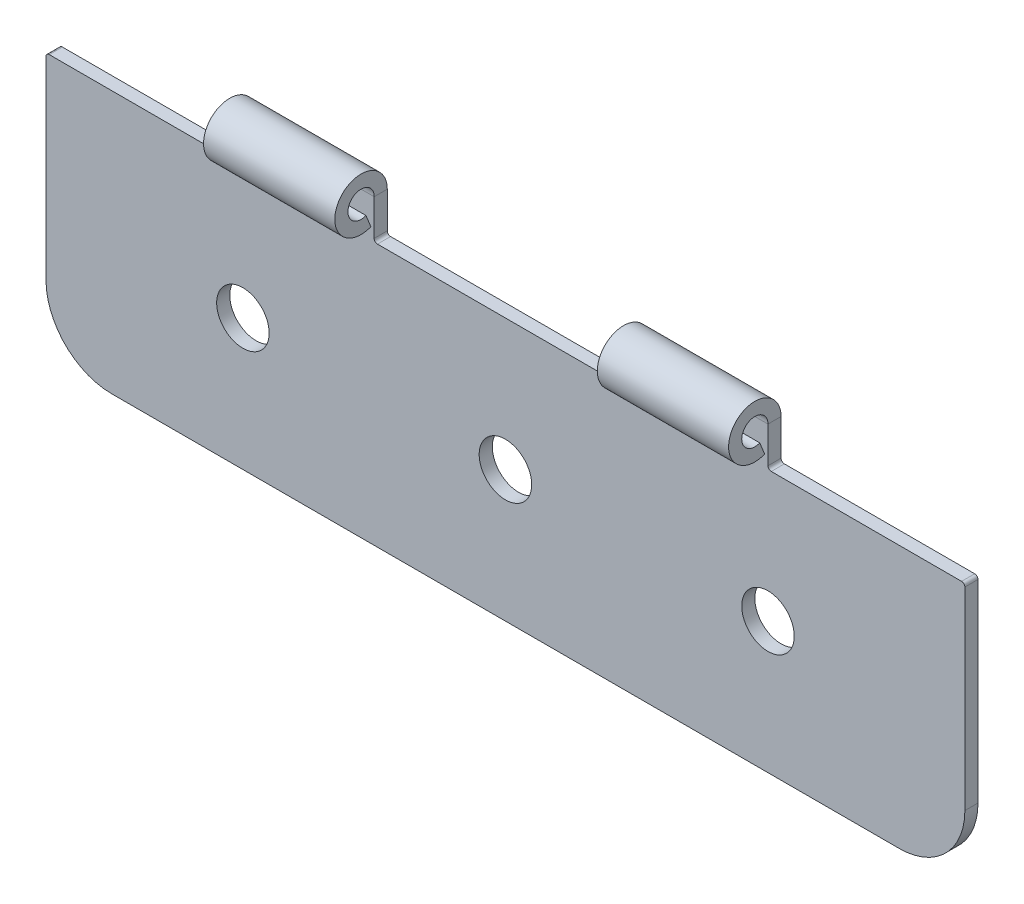
ISO-10303-21;
HEADER;
FILE_DESCRIPTION(('STEP AP214'),'2;1');
FILE_NAME('part.step','',(''),(''),'','','');
FILE_SCHEMA(('AUTOMOTIVE_DESIGN { 1 0 10303 214 1 1 1 1 }'));
ENDSEC;
DATA;
#1=APPLICATION_CONTEXT('core data for automotive mechanical design processes');
#2=APPLICATION_PROTOCOL_DEFINITION('international standard','automotive_design',2000,#1);
#3=PRODUCT_CONTEXT('',#1,'mechanical');
#4=PRODUCT('Part','Part','',(#3));
#5=PRODUCT_RELATED_PRODUCT_CATEGORY('part','',(#4));
#6=PRODUCT_DEFINITION_FORMATION('','',#4);
#7=PRODUCT_DEFINITION_CONTEXT('part definition',#1,'design');
#8=PRODUCT_DEFINITION('design','',#6,#7);
#9=PRODUCT_DEFINITION_SHAPE('','',#8);
#10=(LENGTH_UNIT() NAMED_UNIT(*) SI_UNIT(.MILLI.,.METRE.));
#11=(NAMED_UNIT(*) PLANE_ANGLE_UNIT() SI_UNIT($,.RADIAN.));
#12=(NAMED_UNIT(*) SI_UNIT($,.STERADIAN.) SOLID_ANGLE_UNIT());
#13=UNCERTAINTY_MEASURE_WITH_UNIT(LENGTH_MEASURE(1.E-05),#10,'distance_accuracy_value','');
#14=(GEOMETRIC_REPRESENTATION_CONTEXT(3) GLOBAL_UNCERTAINTY_ASSIGNED_CONTEXT((#13)) GLOBAL_UNIT_ASSIGNED_CONTEXT((#10,
#11,#12)) REPRESENTATION_CONTEXT('',''));
#15=CARTESIAN_POINT('',(0.,0.,0.));
#16=DIRECTION('',(0.,0.,1.));
#17=DIRECTION('',(1.,0.,0.));
#18=AXIS2_PLACEMENT_3D('',#15,#16,#17);
#19=CARTESIAN_POINT('',(85.,52.8350872140625,-3.69698140921907));
#20=DIRECTION('',(-1.,0.,0.));
#21=DIRECTION('',(0.,0.,1.));
#22=AXIS2_PLACEMENT_3D('',#19,#20,#21);
#23=PLANE('',#22);
#24=DIRECTION('',(0.,-1.,0.));
#25=VECTOR('',#24,1.);
#26=CARTESIAN_POINT('',(85.,52.8350872140625,-3.69698140921907));
#27=LINE('',#26,#25);
#28=CARTESIAN_POINT('',(85.,67.8350872140625,-3.69698140921908));
#29=VERTEX_POINT('',#28);
#30=CARTESIAN_POINT('',(85.,54.0850872140625,-3.69698140921907));
#31=VERTEX_POINT('',#30);
#32=EDGE_CURVE('E211',#29,#31,#27,.T.);
#33=ORIENTED_EDGE('',*,*,#32,.T.);
#34=DIRECTION('',(0.,0.,1.));
#35=VECTOR('',#34,1.);
#36=CARTESIAN_POINT('',(85.,54.0850872140625,1.30301859078093));
#37=LINE('',#36,#35);
#38=CARTESIAN_POINT('',(85.,54.0850872140625,1.30301859078093));
#39=VERTEX_POINT('',#38);
#40=EDGE_CURVE('E384',#31,#39,#37,.T.);
#41=ORIENTED_EDGE('',*,*,#40,.T.);
#42=DIRECTION('',(0.,-1.,0.));
#43=VECTOR('',#42,1.);
#44=CARTESIAN_POINT('',(85.,52.8350872140625,1.30301859078093));
#45=LINE('',#44,#43);
#46=CARTESIAN_POINT('',(85.,67.8350872140625,1.30301859078093));
#47=VERTEX_POINT('',#46);
#48=EDGE_CURVE('E327',#47,#39,#45,.T.);
#49=ORIENTED_EDGE('',*,*,#48,.F.);
#50=DIRECTION('',(0.,0.,-1.));
#51=VECTOR('',#50,1.);
#52=CARTESIAN_POINT('',(85.,67.8350872140625,1.30301859078092));
#53=LINE('',#52,#51);
#54=EDGE_CURVE('E223',#47,#29,#53,.T.);
#55=ORIENTED_EDGE('',*,*,#54,.T.);
#56=EDGE_LOOP('',(#33,#41,#49,#55));
#57=FACE_BOUND('',#56,.T.);
#58=ADVANCED_FACE('F44',(#57),#23,.T.);
#59=CARTESIAN_POINT('',(-65.,52.8350872140625,-3.69698140921907));
#60=DIRECTION('',(-1.,0.,0.));
#61=DIRECTION('',(0.,0.,1.));
#62=AXIS2_PLACEMENT_3D('',#59,#60,#61);
#63=PLANE('',#62);
#64=DIRECTION('',(0.,-1.,0.));
#65=VECTOR('',#64,1.);
#66=CARTESIAN_POINT('',(-65.,52.8350872140625,-3.69698140921907));
#67=LINE('',#66,#65);
#68=CARTESIAN_POINT('',(-65.,67.8350872140625,-3.69698140921908));
#69=VERTEX_POINT('',#68);
#70=CARTESIAN_POINT('',(-65.,54.0850872140625,-3.69698140921907));
#71=VERTEX_POINT('',#70);
#72=EDGE_CURVE('E308',#69,#71,#67,.T.);
#73=ORIENTED_EDGE('',*,*,#72,.T.);
#74=DIRECTION('',(0.,0.,1.));
#75=VECTOR('',#74,1.);
#76=CARTESIAN_POINT('',(-65.,54.0850872140625,1.30301859078093));
#77=LINE('',#76,#75);
#78=CARTESIAN_POINT('',(-65.,54.0850872140625,1.30301859078093));
#79=VERTEX_POINT('',#78);
#80=EDGE_CURVE('E387',#71,#79,#77,.T.);
#81=ORIENTED_EDGE('',*,*,#80,.T.);
#82=DIRECTION('',(0.,-1.,0.));
#83=VECTOR('',#82,1.);
#84=CARTESIAN_POINT('',(-65.,52.8350872140625,1.30301859078093));
#85=LINE('',#84,#83);
#86=CARTESIAN_POINT('',(-65.,67.8350872140625,1.30301859078093));
#87=VERTEX_POINT('',#86);
#88=EDGE_CURVE('E335',#87,#79,#85,.T.);
#89=ORIENTED_EDGE('',*,*,#88,.F.);
#90=DIRECTION('',(0.,0.,-1.));
#91=VECTOR('',#90,1.);
#92=CARTESIAN_POINT('',(-65.,67.8350872140625,1.30301859078092));
#93=LINE('',#92,#91);
#94=EDGE_CURVE('E267',#87,#69,#93,.T.);
#95=ORIENTED_EDGE('',*,*,#94,.T.);
#96=EDGE_LOOP('',(#73,#81,#89,#95));
#97=FACE_BOUND('',#96,.T.);
#98=ADVANCED_FACE('F423',(#97),#63,.T.);
#99=CARTESIAN_POINT('',(210.,-47.1649127859375,-3.69698140921907));
#100=DIRECTION('',(0.,-1.,0.));
#101=DIRECTION('',(1.,0.,0.));
#102=AXIS2_PLACEMENT_3D('',#99,#100,#101);
#103=PLANE('',#102);
#104=DIRECTION('',(1.,0.,0.));
#105=VECTOR('',#104,1.);
#106=CARTESIAN_POINT('',(210.,-47.1649127859375,-3.69698140921907));
#107=LINE('',#106,#105);
#108=CARTESIAN_POINT('',(-115.,-47.1649127859375,-3.69698140921907));
#109=VERTEX_POINT('',#108);
#110=CARTESIAN_POINT('',(185.,-47.1649127859375,-3.69698140921907));
#111=VERTEX_POINT('',#110);
#112=EDGE_CURVE('E293',#109,#111,#107,.T.);
#113=ORIENTED_EDGE('',*,*,#112,.T.);
#114=DIRECTION('',(0.,0.,1.));
#115=VECTOR('',#114,1.);
#116=CARTESIAN_POINT('',(185.,-47.1649127859375,-3.69698140921907));
#117=LINE('',#116,#115);
#118=CARTESIAN_POINT('',(185.,-47.1649127859375,1.30301859078093));
#119=VERTEX_POINT('',#118);
#120=EDGE_CURVE('E343',#111,#119,#117,.T.);
#121=ORIENTED_EDGE('',*,*,#120,.T.);
#122=DIRECTION('',(1.,0.,0.));
#123=VECTOR('',#122,1.);
#124=CARTESIAN_POINT('',(210.,-47.1649127859375,1.30301859078093));
#125=LINE('',#124,#123);
#126=CARTESIAN_POINT('',(-115.,-47.1649127859375,1.30301859078093));
#127=VERTEX_POINT('',#126);
#128=EDGE_CURVE('E290',#127,#119,#125,.T.);
#129=ORIENTED_EDGE('',*,*,#128,.F.);
#130=DIRECTION('',(0.,0.,1.));
#131=VECTOR('',#130,1.);
#132=CARTESIAN_POINT('',(-115.,-47.1649127859375,-3.69698140921907));
#133=LINE('',#132,#131);
#134=EDGE_CURVE('E316',#127,#109,#133,.F.);
#135=ORIENTED_EDGE('',*,*,#134,.T.);
#136=EDGE_LOOP('',(#113,#121,#129,#135));
#137=FACE_BOUND('',#136,.T.);
#138=ADVANCED_FACE('F480',(#137),#103,.T.);
#139=CARTESIAN_POINT('',(-140.,-47.1649127859375,-3.69698140921907));
#140=DIRECTION('',(-1.,0.,0.));
#141=DIRECTION('',(0.,0.,1.));
#142=AXIS2_PLACEMENT_3D('',#139,#140,#141);
#143=PLANE('',#142);
#144=DIRECTION('',(0.,-1.,0.));
#145=VECTOR('',#144,1.);
#146=CARTESIAN_POINT('',(-140.,-47.1649127859375,1.30301859078093));
#147=LINE('',#146,#145);
#148=CARTESIAN_POINT('',(-140.,51.5850872140625,1.30301859078093));
#149=VERTEX_POINT('',#148);
#150=CARTESIAN_POINT('',(-140.,-22.1649127859375,1.30301859078093));
#151=VERTEX_POINT('',#150);
#152=EDGE_CURVE('E297',#149,#151,#147,.T.);
#153=ORIENTED_EDGE('',*,*,#152,.F.);
#154=DIRECTION('',(0.,0.,1.));
#155=VECTOR('',#154,1.);
#156=CARTESIAN_POINT('',(-140.,51.5850872140625,-3.69698140921907));
#157=LINE('',#156,#155);
#158=CARTESIAN_POINT('',(-140.,51.5850872140625,-3.69698140921907));
#159=VERTEX_POINT('',#158);
#160=EDGE_CURVE('E395',#149,#159,#157,.F.);
#161=ORIENTED_EDGE('',*,*,#160,.T.);
#162=DIRECTION('',(0.,-1.,0.));
#163=VECTOR('',#162,1.);
#164=CARTESIAN_POINT('',(-140.,-47.1649127859375,-3.69698140921907));
#165=LINE('',#164,#163);
#166=CARTESIAN_POINT('',(-140.,-22.1649127859375,-3.69698140921907));
#167=VERTEX_POINT('',#166);
#168=EDGE_CURVE('E314',#159,#167,#165,.T.);
#169=ORIENTED_EDGE('',*,*,#168,.T.);
#170=DIRECTION('',(0.,0.,1.));
#171=VECTOR('',#170,1.);
#172=CARTESIAN_POINT('',(-140.,-22.1649127859375,-3.69698140921907));
#173=LINE('',#172,#171);
#174=EDGE_CURVE('E357',#167,#151,#173,.T.);
#175=ORIENTED_EDGE('',*,*,#174,.T.);
#176=EDGE_LOOP('',(#153,#161,#169,#175));
#177=FACE_BOUND('',#176,.T.);
#178=ADVANCED_FACE('F497',(#177),#143,.T.);
#179=CARTESIAN_POINT('',(-140.,52.8350872140625,-3.69698140921907));
#180=DIRECTION('',(0.,1.,0.));
#181=DIRECTION('',(0.,0.,1.));
#182=AXIS2_PLACEMENT_3D('',#179,#180,#181);
#183=PLANE('',#182);
#184=DIRECTION('',(-1.,0.,0.));
#185=VECTOR('',#184,1.);
#186=CARTESIAN_POINT('',(-140.,52.8350872140625,1.30301859078093));
#187=LINE('',#186,#185);
#188=CARTESIAN_POINT('',(-66.25,52.8350872140625,1.30301859078093));
#189=VERTEX_POINT('',#188);
#190=CARTESIAN_POINT('',(-138.75,52.8350872140625,1.30301859078093));
#191=VERTEX_POINT('',#190);
#192=EDGE_CURVE('E338',#189,#191,#187,.T.);
#193=ORIENTED_EDGE('',*,*,#192,.F.);
#194=DIRECTION('',(0.,0.,1.));
#195=VECTOR('',#194,1.);
#196=CARTESIAN_POINT('',(-66.25,52.8350872140625,-3.69698140921907));
#197=LINE('',#196,#195);
#198=CARTESIAN_POINT('',(-66.25,52.8350872140625,-3.69698140921907));
#199=VERTEX_POINT('',#198);
#200=EDGE_CURVE('E393',#189,#199,#197,.F.);
#201=ORIENTED_EDGE('',*,*,#200,.T.);
#202=DIRECTION('',(-1.,0.,0.));
#203=VECTOR('',#202,1.);
#204=CARTESIAN_POINT('',(-140.,52.8350872140625,-3.69698140921907));
#205=LINE('',#204,#203);
#206=CARTESIAN_POINT('',(-138.75,52.8350872140625,-3.69698140921907));
#207=VERTEX_POINT('',#206);
#208=EDGE_CURVE('E311',#199,#207,#205,.T.);
#209=ORIENTED_EDGE('',*,*,#208,.T.);
#210=DIRECTION('',(0.,0.,1.));
#211=VECTOR('',#210,1.);
#212=CARTESIAN_POINT('',(-138.75,52.8350872140625,-3.69698140921907));
#213=LINE('',#212,#211);
#214=EDGE_CURVE('E390',#207,#191,#213,.T.);
#215=ORIENTED_EDGE('',*,*,#214,.T.);
#216=EDGE_LOOP('',(#193,#201,#209,#215));
#217=FACE_BOUND('',#216,.T.);
#218=ADVANCED_FACE('F416',(#217),#183,.T.);
#219=CARTESIAN_POINT('',(-15.,77.8350872140625,-3.69698140921907));
#220=DIRECTION('',(1.,0.,0.));
#221=DIRECTION('',(0.,1.,0.));
#222=AXIS2_PLACEMENT_3D('',#219,#220,#221);
#223=PLANE('',#222);
#224=DIRECTION('',(0.,1.,0.));
#225=VECTOR('',#224,1.);
#226=CARTESIAN_POINT('',(-15.,77.8350872140625,1.30301859078093));
#227=LINE('',#226,#225);
#228=CARTESIAN_POINT('',(-15.,54.0850872140625,1.30301859078093));
#229=VERTEX_POINT('',#228);
#230=CARTESIAN_POINT('',(-15.,67.8350872140625,1.30301859078092));
#231=VERTEX_POINT('',#230);
#232=EDGE_CURVE('E333',#229,#231,#227,.T.);
#233=ORIENTED_EDGE('',*,*,#232,.F.);
#234=DIRECTION('',(0.,0.,1.));
#235=VECTOR('',#234,1.);
#236=CARTESIAN_POINT('',(-15.,54.0850872140625,-3.69698140921907));
#237=LINE('',#236,#235);
#238=CARTESIAN_POINT('',(-15.,54.0850872140625,-3.69698140921907));
#239=VERTEX_POINT('',#238);
#240=EDGE_CURVE('E382',#229,#239,#237,.F.);
#241=ORIENTED_EDGE('',*,*,#240,.T.);
#242=DIRECTION('',(0.,1.,0.));
#243=VECTOR('',#242,1.);
#244=CARTESIAN_POINT('',(-15.,77.8350872140625,-3.69698140921907));
#245=LINE('',#244,#243);
#246=CARTESIAN_POINT('',(-15.,67.8350872140625,-3.69698140921908));
#247=VERTEX_POINT('',#246);
#248=EDGE_CURVE('E306',#239,#247,#245,.T.);
#249=ORIENTED_EDGE('',*,*,#248,.T.);
#250=DIRECTION('',(0.,0.,-1.));
#251=VECTOR('',#250,1.);
#252=CARTESIAN_POINT('',(-15.,67.8350872140625,1.30301859078092));
#253=LINE('',#252,#251);
#254=EDGE_CURVE('E283',#231,#247,#253,.T.);
#255=ORIENTED_EDGE('',*,*,#254,.F.);
#256=EDGE_LOOP('',(#233,#241,#249,#255));
#257=FACE_BOUND('',#256,.T.);
#258=ADVANCED_FACE('F439',(#257),#223,.T.);
#259=CARTESIAN_POINT('',(-15.,52.8350872140625,-3.69698140921907));
#260=DIRECTION('',(0.,1.,0.));
#261=DIRECTION('',(0.,0.,1.));
#262=AXIS2_PLACEMENT_3D('',#259,#260,#261);
#263=PLANE('',#262);
#264=DIRECTION('',(-1.,0.,0.));
#265=VECTOR('',#264,1.);
#266=CARTESIAN_POINT('',(-15.,52.8350872140625,-3.69698140921907));
#267=LINE('',#266,#265);
#268=CARTESIAN_POINT('',(83.75,52.8350872140625,-3.69698140921907));
#269=VERTEX_POINT('',#268);
#270=CARTESIAN_POINT('',(-13.75,52.8350872140625,-3.69698140921907));
#271=VERTEX_POINT('',#270);
#272=EDGE_CURVE('E303',#269,#271,#267,.T.);
#273=ORIENTED_EDGE('',*,*,#272,.T.);
#274=DIRECTION('',(0.,0.,1.));
#275=VECTOR('',#274,1.);
#276=CARTESIAN_POINT('',(-13.75,52.8350872140625,1.30301859078093));
#277=LINE('',#276,#275);
#278=CARTESIAN_POINT('',(-13.75,52.8350872140625,1.30301859078093));
#279=VERTEX_POINT('',#278);
#280=EDGE_CURVE('E379',#271,#279,#277,.T.);
#281=ORIENTED_EDGE('',*,*,#280,.T.);
#282=DIRECTION('',(-1.,0.,0.));
#283=VECTOR('',#282,1.);
#284=CARTESIAN_POINT('',(-15.,52.8350872140625,1.30301859078093));
#285=LINE('',#284,#283);
#286=CARTESIAN_POINT('',(83.75,52.8350872140625,1.30301859078093));
#287=VERTEX_POINT('',#286);
#288=EDGE_CURVE('E330',#287,#279,#285,.T.);
#289=ORIENTED_EDGE('',*,*,#288,.F.);
#290=DIRECTION('',(0.,0.,1.));
#291=VECTOR('',#290,1.);
#292=CARTESIAN_POINT('',(83.75,52.8350872140625,-3.69698140921907));
#293=LINE('',#292,#291);
#294=EDGE_CURVE('E377',#287,#269,#293,.F.);
#295=ORIENTED_EDGE('',*,*,#294,.T.);
#296=EDGE_LOOP('',(#273,#281,#289,#295));
#297=FACE_BOUND('',#296,.T.);
#298=ADVANCED_FACE('F448',(#297),#263,.T.);
#299=CARTESIAN_POINT('',(135.,77.8350872140625,-3.69698140921907));
#300=DIRECTION('',(1.,0.,0.));
#301=DIRECTION('',(0.,0.,-1.));
#302=AXIS2_PLACEMENT_3D('',#299,#300,#301);
#303=PLANE('',#302);
#304=DIRECTION('',(0.,1.,0.));
#305=VECTOR('',#304,1.);
#306=CARTESIAN_POINT('',(135.,77.8350872140625,1.30301859078093));
#307=LINE('',#306,#305);
#308=CARTESIAN_POINT('',(135.,54.0850872140625,1.30301859078093));
#309=VERTEX_POINT('',#308);
#310=CARTESIAN_POINT('',(135.,67.8350872140625,1.30301859078092));
#311=VERTEX_POINT('',#310);
#312=EDGE_CURVE('E325',#309,#311,#307,.T.);
#313=ORIENTED_EDGE('',*,*,#312,.F.);
#314=DIRECTION('',(0.,0.,1.));
#315=VECTOR('',#314,1.);
#316=CARTESIAN_POINT('',(135.,54.0850872140625,-3.69698140921907));
#317=LINE('',#316,#315);
#318=CARTESIAN_POINT('',(135.,54.0850872140625,-3.69698140921907));
#319=VERTEX_POINT('',#318);
#320=EDGE_CURVE('E59',#309,#319,#317,.F.);
#321=ORIENTED_EDGE('',*,*,#320,.T.);
#322=DIRECTION('',(0.,1.,0.));
#323=VECTOR('',#322,1.);
#324=CARTESIAN_POINT('',(135.,77.8350872140625,-3.69698140921907));
#325=LINE('',#324,#323);
#326=CARTESIAN_POINT('',(135.,67.8350872140625,-3.69698140921908));
#327=VERTEX_POINT('',#326);
#328=EDGE_CURVE('E205',#319,#327,#325,.T.);
#329=ORIENTED_EDGE('',*,*,#328,.T.);
#330=DIRECTION('',(0.,0.,-1.));
#331=VECTOR('',#330,1.);
#332=CARTESIAN_POINT('',(135.,67.8350872140625,1.30301859078092));
#333=LINE('',#332,#331);
#334=EDGE_CURVE('E208',#311,#327,#333,.T.);
#335=ORIENTED_EDGE('',*,*,#334,.F.);
#336=EDGE_LOOP('',(#313,#321,#329,#335));
#337=FACE_BOUND('',#336,.T.);
#338=ADVANCED_FACE('F207',(#337),#303,.T.);
#339=CARTESIAN_POINT('',(135.,52.8350872140625,-3.69698140921907));
#340=DIRECTION('',(0.,1.,0.));
#341=DIRECTION('',(0.,0.,1.));
#342=AXIS2_PLACEMENT_3D('',#339,#340,#341);
#343=PLANE('',#342);
#344=DIRECTION('',(-1.,0.,0.));
#345=VECTOR('',#344,1.);
#346=CARTESIAN_POINT('',(135.,52.8350872140625,1.30301859078093));
#347=LINE('',#346,#345);
#348=CARTESIAN_POINT('',(208.75,52.8350872140625,1.30301859078093));
#349=VERTEX_POINT('',#348);
#350=CARTESIAN_POINT('',(136.25,52.8350872140625,1.30301859078093));
#351=VERTEX_POINT('',#350);
#352=EDGE_CURVE('E322',#349,#351,#347,.T.);
#353=ORIENTED_EDGE('',*,*,#352,.F.);
#354=DIRECTION('',(0.,0.,1.));
#355=VECTOR('',#354,1.);
#356=CARTESIAN_POINT('',(208.75,52.8350872140625,-3.69698140921907));
#357=LINE('',#356,#355);
#358=CARTESIAN_POINT('',(208.75,52.8350872140625,-3.69698140921907));
#359=VERTEX_POINT('',#358);
#360=EDGE_CURVE('E370',#349,#359,#357,.F.);
#361=ORIENTED_EDGE('',*,*,#360,.T.);
#362=DIRECTION('',(-1.,0.,0.));
#363=VECTOR('',#362,1.);
#364=CARTESIAN_POINT('',(135.,52.8350872140625,-3.69698140921907));
#365=LINE('',#364,#363);
#366=CARTESIAN_POINT('',(136.25,52.8350872140625,-3.69698140921907));
#367=VERTEX_POINT('',#366);
#368=EDGE_CURVE('E212',#359,#367,#365,.T.);
#369=ORIENTED_EDGE('',*,*,#368,.T.);
#370=DIRECTION('',(0.,0.,1.));
#371=VECTOR('',#370,1.);
#372=CARTESIAN_POINT('',(136.25,52.8350872140625,1.30301859078093));
#373=LINE('',#372,#371);
#374=EDGE_CURVE('E367',#367,#351,#373,.T.);
#375=ORIENTED_EDGE('',*,*,#374,.T.);
#376=EDGE_LOOP('',(#353,#361,#369,#375));
#377=FACE_BOUND('',#376,.T.);
#378=ADVANCED_FACE('F487',(#377),#343,.T.);
#379=CARTESIAN_POINT('',(210.,52.8350872140625,-3.69698140921907));
#380=DIRECTION('',(1.,0.,0.));
#381=DIRECTION('',(0.,0.,-1.));
#382=AXIS2_PLACEMENT_3D('',#379,#380,#381);
#383=PLANE('',#382);
#384=DIRECTION('',(0.,1.,0.));
#385=VECTOR('',#384,1.);
#386=CARTESIAN_POINT('',(210.,52.8350872140625,-3.69698140921907));
#387=LINE('',#386,#385);
#388=CARTESIAN_POINT('',(210.,-22.1649127859375,-3.69698140921907));
#389=VERTEX_POINT('',#388);
#390=CARTESIAN_POINT('',(210.,51.5850872140625,-3.69698140921907));
#391=VERTEX_POINT('',#390);
#392=EDGE_CURVE('E296',#389,#391,#387,.T.);
#393=ORIENTED_EDGE('',*,*,#392,.T.);
#394=DIRECTION('',(0.,0.,1.));
#395=VECTOR('',#394,1.);
#396=CARTESIAN_POINT('',(210.,51.5850872140625,-3.69698140921907));
#397=LINE('',#396,#395);
#398=CARTESIAN_POINT('',(210.,51.5850872140625,1.30301859078093));
#399=VERTEX_POINT('',#398);
#400=EDGE_CURVE('E360',#391,#399,#397,.T.);
#401=ORIENTED_EDGE('',*,*,#400,.T.);
#402=DIRECTION('',(0.,1.,0.));
#403=VECTOR('',#402,1.);
#404=CARTESIAN_POINT('',(210.,52.8350872140625,1.30301859078093));
#405=LINE('',#404,#403);
#406=CARTESIAN_POINT('',(210.,-22.1649127859375,1.30301859078093));
#407=VERTEX_POINT('',#406);
#408=EDGE_CURVE('E319',#407,#399,#405,.T.);
#409=ORIENTED_EDGE('',*,*,#408,.F.);
#410=DIRECTION('',(0.,0.,1.));
#411=VECTOR('',#410,1.);
#412=CARTESIAN_POINT('',(210.,-22.1649127859375,-3.69698140921907));
#413=LINE('',#412,#411);
#414=EDGE_CURVE('E350',#407,#389,#413,.F.);
#415=ORIENTED_EDGE('',*,*,#414,.T.);
#416=EDGE_LOOP('',(#393,#401,#409,#415));
#417=FACE_BOUND('',#416,.T.);
#418=ADVANCED_FACE('F490',(#417),#383,.T.);
#419=CARTESIAN_POINT('',(-140.,-47.1649127859375,-3.69698140921907));
#420=DIRECTION('',(0.,0.,-1.));
#421=DIRECTION('',(-1.,0.,0.));
#422=AXIS2_PLACEMENT_3D('',#419,#420,#421);
#423=PLANE('',#422);
#424=CARTESIAN_POINT('',(135.,2.83508721406253,-3.69698140921908));
#425=DIRECTION('',(0.,0.,1.));
#426=DIRECTION('',(1.,0.,0.));
#427=AXIS2_PLACEMENT_3D('',#424,#425,#426);
#428=CIRCLE('',#427,10.);
#429=CARTESIAN_POINT('',(145.,2.83508721406253,-3.69698140921908));
#430=VERTEX_POINT('',#429);
#431=EDGE_CURVE('E905',#430,#430,#428,.T.);
#432=ORIENTED_EDGE('',*,*,#431,.T.);
#433=EDGE_LOOP('',(#432));
#434=FACE_BOUND('',#433,.T.);
#435=CARTESIAN_POINT('',(35.,2.83508721406252,-3.69698140921908));
#436=DIRECTION('',(0.,0.,1.));
#437=DIRECTION('',(1.,0.,0.));
#438=AXIS2_PLACEMENT_3D('',#435,#436,#437);
#439=CIRCLE('',#438,10.);
#440=CARTESIAN_POINT('',(45.,2.83508721406252,-3.69698140921908));
#441=VERTEX_POINT('',#440);
#442=EDGE_CURVE('E913',#441,#441,#439,.T.);
#443=ORIENTED_EDGE('',*,*,#442,.T.);
#444=EDGE_LOOP('',(#443));
#445=FACE_BOUND('',#444,.T.);
#446=CARTESIAN_POINT('',(-65.,2.83508721406252,-3.69698140921908));
#447=DIRECTION('',(0.,0.,1.));
#448=DIRECTION('',(1.,0.,0.));
#449=AXIS2_PLACEMENT_3D('',#446,#447,#448);
#450=CIRCLE('',#449,10.);
#451=CARTESIAN_POINT('',(-55.,2.83508721406252,-3.69698140921908));
#452=VERTEX_POINT('',#451);
#453=EDGE_CURVE('E252',#452,#452,#450,.T.);
#454=ORIENTED_EDGE('',*,*,#453,.T.);
#455=EDGE_LOOP('',(#454));
#456=FACE_BOUND('',#455,.T.);
#457=ORIENTED_EDGE('',*,*,#368,.F.);
#458=CARTESIAN_POINT('',(208.75,51.5850872140625,-3.69698140921907));
#459=DIRECTION('',(0.,0.,-1.));
#460=DIRECTION('',(-1.,0.,0.));
#461=AXIS2_PLACEMENT_3D('',#458,#459,#460);
#462=CIRCLE('',#461,1.25);
#463=EDGE_CURVE('E374',#359,#391,#462,.T.);
#464=ORIENTED_EDGE('',*,*,#463,.T.);
#465=ORIENTED_EDGE('',*,*,#392,.F.);
#466=CARTESIAN_POINT('',(185.,-22.1649127859375,-3.69698140921907));
#467=DIRECTION('',(0.,0.,-1.));
#468=DIRECTION('',(-1.,0.,0.));
#469=AXIS2_PLACEMENT_3D('',#466,#467,#468);
#470=CIRCLE('',#469,25.);
#471=EDGE_CURVE('E355',#389,#111,#470,.T.);
#472=ORIENTED_EDGE('',*,*,#471,.T.);
#473=ORIENTED_EDGE('',*,*,#112,.F.);
#474=CARTESIAN_POINT('',(-115.,-22.1649127859375,-3.69698140921907));
#475=DIRECTION('',(0.,0.,-1.));
#476=DIRECTION('',(-1.,0.,0.));
#477=AXIS2_PLACEMENT_3D('',#474,#475,#476);
#478=CIRCLE('',#477,25.);
#479=EDGE_CURVE('E352',#109,#167,#478,.T.);
#480=ORIENTED_EDGE('',*,*,#479,.T.);
#481=ORIENTED_EDGE('',*,*,#168,.F.);
#482=CARTESIAN_POINT('',(-138.75,51.5850872140625,-3.69698140921907));
#483=DIRECTION('',(0.,0.,-1.));
#484=DIRECTION('',(-1.,0.,0.));
#485=AXIS2_PLACEMENT_3D('',#482,#483,#484);
#486=CIRCLE('',#485,1.25);
#487=EDGE_CURVE('E372',#159,#207,#486,.T.);
#488=ORIENTED_EDGE('',*,*,#487,.T.);
#489=ORIENTED_EDGE('',*,*,#208,.F.);
#490=CARTESIAN_POINT('',(-66.25,54.0850872140625,-3.69698140921907));
#491=DIRECTION('',(0.,0.,-1.));
#492=DIRECTION('',(-1.,0.,0.));
#493=AXIS2_PLACEMENT_3D('',#490,#491,#492);
#494=CIRCLE('',#493,1.25);
#495=EDGE_CURVE('E11',#199,#71,#494,.F.);
#496=ORIENTED_EDGE('',*,*,#495,.T.);
#497=ORIENTED_EDGE('',*,*,#72,.F.);
#498=DIRECTION('',(-1.,0.,0.));
#499=VECTOR('',#498,1.);
#500=CARTESIAN_POINT('',(-65.,67.8350872140625,-3.69698140921908));
#501=LINE('',#500,#499);
#502=EDGE_CURVE('E260',#69,#247,#501,.F.);
#503=ORIENTED_EDGE('',*,*,#502,.T.);
#504=ORIENTED_EDGE('',*,*,#248,.F.);
#505=CARTESIAN_POINT('',(-13.75,54.0850872140625,-3.69698140921907));
#506=DIRECTION('',(0.,0.,-1.));
#507=DIRECTION('',(-1.,0.,0.));
#508=AXIS2_PLACEMENT_3D('',#505,#506,#507);
#509=CIRCLE('',#508,1.25);
#510=EDGE_CURVE('E403',#239,#271,#509,.F.);
#511=ORIENTED_EDGE('',*,*,#510,.T.);
#512=ORIENTED_EDGE('',*,*,#272,.F.);
#513=CARTESIAN_POINT('',(83.75,54.0850872140625,-3.69698140921907));
#514=DIRECTION('',(0.,0.,-1.));
#515=DIRECTION('',(-1.,0.,0.));
#516=AXIS2_PLACEMENT_3D('',#513,#514,#515);
#517=CIRCLE('',#516,1.25);
#518=EDGE_CURVE('E67',#269,#31,#517,.F.);
#519=ORIENTED_EDGE('',*,*,#518,.T.);
#520=ORIENTED_EDGE('',*,*,#32,.F.);
#521=DIRECTION('',(-1.,0.,0.));
#522=VECTOR('',#521,1.);
#523=CARTESIAN_POINT('',(85.,67.8350872140625,-3.69698140921908));
#524=LINE('',#523,#522);
#525=EDGE_CURVE('E229',#29,#327,#524,.F.);
#526=ORIENTED_EDGE('',*,*,#525,.T.);
#527=ORIENTED_EDGE('',*,*,#328,.F.);
#528=CARTESIAN_POINT('',(136.25,54.0850872140625,-3.69698140921907));
#529=DIRECTION('',(0.,0.,-1.));
#530=DIRECTION('',(-1.,0.,0.));
#531=AXIS2_PLACEMENT_3D('',#528,#529,#530);
#532=CIRCLE('',#531,1.25);
#533=EDGE_CURVE('E399',#319,#367,#532,.F.);
#534=ORIENTED_EDGE('',*,*,#533,.T.);
#535=EDGE_LOOP('',(#457,#464,#465,#472,#473,#480,#481,#488,#489,#496,#497,#503,#504,#511,#512,
#519,#520,#526,#527,#534));
#536=FACE_BOUND('',#535,.T.);
#537=ADVANCED_FACE('F235',(#434,#445,#456,#536),#423,.T.);
#538=CARTESIAN_POINT('',(-140.,-47.1649127859375,1.30301859078093));
#539=DIRECTION('',(0.,0.,-1.));
#540=DIRECTION('',(-1.,0.,0.));
#541=AXIS2_PLACEMENT_3D('',#538,#539,#540);
#542=PLANE('',#541);
#543=CARTESIAN_POINT('',(135.,2.83508721406253,1.30301859078093));
#544=DIRECTION('',(0.,0.,1.));
#545=DIRECTION('',(1.,0.,0.));
#546=AXIS2_PLACEMENT_3D('',#543,#544,#545);
#547=CIRCLE('',#546,10.);
#548=CARTESIAN_POINT('',(145.,2.83508721406253,1.30301859078093));
#549=VERTEX_POINT('',#548);
#550=EDGE_CURVE('E908',#549,#549,#547,.T.);
#551=ORIENTED_EDGE('',*,*,#550,.F.);
#552=EDGE_LOOP('',(#551));
#553=FACE_BOUND('',#552,.T.);
#554=CARTESIAN_POINT('',(35.,2.83508721406252,1.30301859078093));
#555=DIRECTION('',(0.,0.,1.));
#556=DIRECTION('',(1.,0.,0.));
#557=AXIS2_PLACEMENT_3D('',#554,#555,#556);
#558=CIRCLE('',#557,10.);
#559=CARTESIAN_POINT('',(45.,2.83508721406252,1.30301859078093));
#560=VERTEX_POINT('',#559);
#561=EDGE_CURVE('E910',#560,#560,#558,.T.);
#562=ORIENTED_EDGE('',*,*,#561,.F.);
#563=EDGE_LOOP('',(#562));
#564=FACE_BOUND('',#563,.T.);
#565=CARTESIAN_POINT('',(-65.,2.83508721406252,1.30301859078093));
#566=DIRECTION('',(0.,0.,1.));
#567=DIRECTION('',(1.,0.,0.));
#568=AXIS2_PLACEMENT_3D('',#565,#566,#567);
#569=CIRCLE('',#568,10.);
#570=CARTESIAN_POINT('',(-55.,2.83508721406252,1.30301859078093));
#571=VERTEX_POINT('',#570);
#572=EDGE_CURVE('E240',#571,#571,#569,.T.);
#573=ORIENTED_EDGE('',*,*,#572,.F.);
#574=EDGE_LOOP('',(#573));
#575=FACE_BOUND('',#574,.T.);
#576=ORIENTED_EDGE('',*,*,#408,.T.);
#577=CARTESIAN_POINT('',(208.75,51.5850872140625,1.30301859078093));
#578=DIRECTION('',(0.,0.,-1.));
#579=DIRECTION('',(-1.,0.,0.));
#580=AXIS2_PLACEMENT_3D('',#577,#578,#579);
#581=CIRCLE('',#580,1.25);
#582=EDGE_CURVE('E365',#399,#349,#581,.F.);
#583=ORIENTED_EDGE('',*,*,#582,.T.);
#584=ORIENTED_EDGE('',*,*,#352,.T.);
#585=CARTESIAN_POINT('',(136.25,54.0850872140625,1.30301859078093));
#586=DIRECTION('',(0.,0.,-1.));
#587=DIRECTION('',(-1.,0.,0.));
#588=AXIS2_PLACEMENT_3D('',#585,#586,#587);
#589=CIRCLE('',#588,1.25);
#590=EDGE_CURVE('E397',#351,#309,#589,.T.);
#591=ORIENTED_EDGE('',*,*,#590,.T.);
#592=ORIENTED_EDGE('',*,*,#312,.T.);
#593=DIRECTION('',(-1.,0.,0.));
#594=VECTOR('',#593,1.);
#595=CARTESIAN_POINT('',(85.,67.8350872140625,1.30301859078092));
#596=LINE('',#595,#594);
#597=EDGE_CURVE('E245',#47,#311,#596,.F.);
#598=ORIENTED_EDGE('',*,*,#597,.F.);
#599=ORIENTED_EDGE('',*,*,#48,.T.);
#600=CARTESIAN_POINT('',(83.75,54.0850872140625,1.30301859078093));
#601=DIRECTION('',(0.,0.,-1.));
#602=DIRECTION('',(-1.,0.,0.));
#603=AXIS2_PLACEMENT_3D('',#600,#601,#602);
#604=CIRCLE('',#603,1.25);
#605=EDGE_CURVE('E405',#39,#287,#604,.T.);
#606=ORIENTED_EDGE('',*,*,#605,.T.);
#607=ORIENTED_EDGE('',*,*,#288,.T.);
#608=CARTESIAN_POINT('',(-13.75,54.0850872140625,1.30301859078093));
#609=DIRECTION('',(0.,0.,-1.));
#610=DIRECTION('',(-1.,0.,0.));
#611=AXIS2_PLACEMENT_3D('',#608,#609,#610);
#612=CIRCLE('',#611,1.25);
#613=EDGE_CURVE('E401',#279,#229,#612,.T.);
#614=ORIENTED_EDGE('',*,*,#613,.T.);
#615=ORIENTED_EDGE('',*,*,#232,.T.);
#616=DIRECTION('',(-1.,0.,0.));
#617=VECTOR('',#616,1.);
#618=CARTESIAN_POINT('',(-65.,67.8350872140625,1.30301859078092));
#619=LINE('',#618,#617);
#620=EDGE_CURVE('E276',#87,#231,#619,.F.);
#621=ORIENTED_EDGE('',*,*,#620,.F.);
#622=ORIENTED_EDGE('',*,*,#88,.T.);
#623=CARTESIAN_POINT('',(-66.25,54.0850872140625,1.30301859078093));
#624=DIRECTION('',(0.,0.,-1.));
#625=DIRECTION('',(-1.,0.,0.));
#626=AXIS2_PLACEMENT_3D('',#623,#624,#625);
#627=CIRCLE('',#626,1.25);
#628=EDGE_CURVE('E52',#79,#189,#627,.T.);
#629=ORIENTED_EDGE('',*,*,#628,.T.);
#630=ORIENTED_EDGE('',*,*,#192,.T.);
#631=CARTESIAN_POINT('',(-138.75,51.5850872140625,1.30301859078093));
#632=DIRECTION('',(0.,0.,-1.));
#633=DIRECTION('',(-1.,0.,0.));
#634=AXIS2_PLACEMENT_3D('',#631,#632,#633);
#635=CIRCLE('',#634,1.25);
#636=EDGE_CURVE('E363',#191,#149,#635,.F.);
#637=ORIENTED_EDGE('',*,*,#636,.T.);
#638=ORIENTED_EDGE('',*,*,#152,.T.);
#639=CARTESIAN_POINT('',(-115.,-22.1649127859375,1.30301859078093));
#640=DIRECTION('',(0.,0.,-1.));
#641=DIRECTION('',(-1.,0.,0.));
#642=AXIS2_PLACEMENT_3D('',#639,#640,#641);
#643=CIRCLE('',#642,25.);
#644=EDGE_CURVE('E346',#151,#127,#643,.F.);
#645=ORIENTED_EDGE('',*,*,#644,.T.);
#646=ORIENTED_EDGE('',*,*,#128,.T.);
#647=CARTESIAN_POINT('',(185.,-22.1649127859375,1.30301859078093));
#648=DIRECTION('',(0.,0.,-1.));
#649=DIRECTION('',(-1.,0.,0.));
#650=AXIS2_PLACEMENT_3D('',#647,#648,#649);
#651=CIRCLE('',#650,25.);
#652=EDGE_CURVE('E348',#119,#407,#651,.F.);
#653=ORIENTED_EDGE('',*,*,#652,.T.);
#654=EDGE_LOOP('',(#576,#583,#584,#591,#592,#598,#599,#606,#607,#614,#615,#621,#622,#629,#630,
#637,#638,#645,#646,#653));
#655=FACE_BOUND('',#654,.T.);
#656=ADVANCED_FACE('F409',(#553,#564,#575,#655),#542,.F.);
#657=CARTESIAN_POINT('',(-40.,63.1991679412286,4.42998562370133));
#658=DIRECTION('',(0.,-0.374606593415919,0.927183854566785));
#659=DIRECTION('',(-1.,0.,0.));
#660=AXIS2_PLACEMENT_3D('',#657,#658,#659);
#661=PLANE('',#660);
#662=DIRECTION('',(0.,-0.927183854566785,-0.374606593415919));
#663=VECTOR('',#662,1.);
#664=CARTESIAN_POINT('',(-65.,63.1991679412286,4.42998562370133));
#665=LINE('',#664,#663);
#666=CARTESIAN_POINT('',(-65.,63.1991679412286,4.42998562370133));
#667=VERTEX_POINT('',#666);
#668=CARTESIAN_POINT('',(-65.,58.5632486683947,2.55695265662173));
#669=VERTEX_POINT('',#668);
#670=EDGE_CURVE('E288',#667,#669,#665,.T.);
#671=ORIENTED_EDGE('',*,*,#670,.F.);
#672=DIRECTION('',(-1.,0.,0.));
#673=VECTOR('',#672,1.);
#674=CARTESIAN_POINT('',(-65.,63.1991679412286,4.42998562370133));
#675=LINE('',#674,#673);
#676=CARTESIAN_POINT('',(-15.,63.1991679412286,4.42998562370133));
#677=VERTEX_POINT('',#676);
#678=EDGE_CURVE('E257',#677,#667,#675,.T.);
#679=ORIENTED_EDGE('',*,*,#678,.F.);
#680=DIRECTION('',(0.,-0.927183854566785,-0.374606593415919));
#681=VECTOR('',#680,1.);
#682=CARTESIAN_POINT('',(-15.,63.1991679412286,4.42998562370133));
#683=LINE('',#682,#681);
#684=CARTESIAN_POINT('',(-15.,58.5632486683947,2.55695265662173));
#685=VERTEX_POINT('',#684);
#686=EDGE_CURVE('E286',#677,#685,#683,.T.);
#687=ORIENTED_EDGE('',*,*,#686,.T.);
#688=DIRECTION('',(-1.,0.,0.));
#689=VECTOR('',#688,1.);
#690=CARTESIAN_POINT('',(-65.,58.5632486683947,2.55695265662173));
#691=LINE('',#690,#689);
#692=EDGE_CURVE('E268',#685,#669,#691,.T.);
#693=ORIENTED_EDGE('',*,*,#692,.T.);
#694=EDGE_LOOP('',(#671,#679,#687,#693));
#695=FACE_BOUND('',#694,.T.);
#696=ADVANCED_FACE('F585',(#695),#661,.F.);
#697=CARTESIAN_POINT('',(-15.,67.8350872140625,6.30301859078093));
#698=DIRECTION('',(1.,0.,0.));
#699=DIRECTION('',(0.,0.,-1.));
#700=AXIS2_PLACEMENT_3D('',#697,#698,#699);
#701=PLANE('',#700);
#702=ORIENTED_EDGE('',*,*,#686,.F.);
#703=CARTESIAN_POINT('',(-15.,67.8350872140625,6.30301859078093));
#704=DIRECTION('',(-1.,0.,0.));
#705=DIRECTION('',(0.,0.,1.));
#706=AXIS2_PLACEMENT_3D('',#703,#704,#705);
#707=CIRCLE('',#706,5.00000000000001);
#708=EDGE_CURVE('E271',#231,#677,#707,.F.);
#709=ORIENTED_EDGE('',*,*,#708,.F.);
#710=ORIENTED_EDGE('',*,*,#254,.T.);
#711=CARTESIAN_POINT('',(-15.,67.8350872140625,6.30301859078093));
#712=DIRECTION('',(-1.,0.,0.));
#713=DIRECTION('',(0.,0.,1.));
#714=AXIS2_PLACEMENT_3D('',#711,#712,#713);
#715=CIRCLE('',#714,10.);
#716=EDGE_CURVE('E263',#247,#685,#715,.F.);
#717=ORIENTED_EDGE('',*,*,#716,.T.);
#718=EDGE_LOOP('',(#702,#709,#710,#717));
#719=FACE_BOUND('',#718,.T.);
#720=ADVANCED_FACE('F435',(#719),#701,.T.);
#721=CARTESIAN_POINT('',(-65.,67.8350872140625,6.30301859078093));
#722=DIRECTION('',(1.,0.,0.));
#723=DIRECTION('',(0.,0.,-1.));
#724=AXIS2_PLACEMENT_3D('',#721,#722,#723);
#725=PLANE('',#724);
#726=CARTESIAN_POINT('',(-65.,67.8350872140625,6.30301859078093));
#727=DIRECTION('',(-1.,0.,0.));
#728=DIRECTION('',(0.,0.,1.));
#729=AXIS2_PLACEMENT_3D('',#726,#727,#728);
#730=CIRCLE('',#729,5.00000000000001);
#731=EDGE_CURVE('E279',#667,#87,#730,.T.);
#732=ORIENTED_EDGE('',*,*,#731,.F.);
#733=ORIENTED_EDGE('',*,*,#670,.T.);
#734=CARTESIAN_POINT('',(-65.,67.8350872140625,6.30301859078093));
#735=DIRECTION('',(-1.,0.,0.));
#736=DIRECTION('',(0.,0.,1.));
#737=AXIS2_PLACEMENT_3D('',#734,#735,#736);
#738=CIRCLE('',#737,10.);
#739=EDGE_CURVE('E264',#669,#69,#738,.T.);
#740=ORIENTED_EDGE('',*,*,#739,.T.);
#741=ORIENTED_EDGE('',*,*,#94,.F.);
#742=EDGE_LOOP('',(#732,#733,#740,#741));
#743=FACE_BOUND('',#742,.T.);
#744=ADVANCED_FACE('F427',(#743),#725,.F.);
#745=CARTESIAN_POINT('',(-65.,67.8350872140625,6.30301859078093));
#746=DIRECTION('',(-1.,0.,0.));
#747=DIRECTION('',(0.,-0.927183854566784,-0.374606593415919));
#748=AXIS2_PLACEMENT_3D('',#745,#746,#747);
#749=CYLINDRICAL_SURFACE('',#748,10.);
#750=ORIENTED_EDGE('',*,*,#502,.F.);
#751=ORIENTED_EDGE('',*,*,#739,.F.);
#752=ORIENTED_EDGE('',*,*,#692,.F.);
#753=ORIENTED_EDGE('',*,*,#716,.F.);
#754=EDGE_LOOP('',(#750,#751,#752,#753));
#755=FACE_BOUND('',#754,.T.);
#756=ADVANCED_FACE('F472',(#755),#749,.T.);
#757=CARTESIAN_POINT('',(-65.,67.8350872140625,6.30301859078093));
#758=DIRECTION('',(-1.,0.,0.));
#759=DIRECTION('',(0.,-0.927183854566784,-0.374606593415919));
#760=AXIS2_PLACEMENT_3D('',#757,#758,#759);
#761=CYLINDRICAL_SURFACE('',#760,5.00000000000001);
#762=ORIENTED_EDGE('',*,*,#620,.T.);
#763=ORIENTED_EDGE('',*,*,#708,.T.);
#764=ORIENTED_EDGE('',*,*,#678,.T.);
#765=ORIENTED_EDGE('',*,*,#731,.T.);
#766=EDGE_LOOP('',(#762,#763,#764,#765));
#767=FACE_BOUND('',#766,.T.);
#768=ADVANCED_FACE('F432',(#767),#761,.F.);
#769=CARTESIAN_POINT('',(110.,63.1991679412286,4.42998562370133));
#770=DIRECTION('',(0.,-0.374606593415919,0.927183854566785));
#771=DIRECTION('',(-1.,0.,0.));
#772=AXIS2_PLACEMENT_3D('',#769,#770,#771);
#773=PLANE('',#772);
#774=DIRECTION('',(0.,-0.927183854566785,-0.374606593415919));
#775=VECTOR('',#774,1.);
#776=CARTESIAN_POINT('',(85.,63.1991679412286,4.42998562370133));
#777=LINE('',#776,#775);
#778=CARTESIAN_POINT('',(85.,63.1991679412286,4.42998562370133));
#779=VERTEX_POINT('',#778);
#780=CARTESIAN_POINT('',(85.,58.5632486683947,2.55695265662173));
#781=VERTEX_POINT('',#780);
#782=EDGE_CURVE('E255',#779,#781,#777,.T.);
#783=ORIENTED_EDGE('',*,*,#782,.F.);
#784=DIRECTION('',(-1.,0.,0.));
#785=VECTOR('',#784,1.);
#786=CARTESIAN_POINT('',(85.,63.1991679412286,4.42998562370133));
#787=LINE('',#786,#785);
#788=CARTESIAN_POINT('',(135.,63.1991679412286,4.42998562370133));
#789=VERTEX_POINT('',#788);
#790=EDGE_CURVE('E250',#789,#779,#787,.T.);
#791=ORIENTED_EDGE('',*,*,#790,.F.);
#792=DIRECTION('',(0.,-0.927183854566785,-0.374606593415919));
#793=VECTOR('',#792,1.);
#794=CARTESIAN_POINT('',(135.,63.1991679412286,4.42998562370133));
#795=LINE('',#794,#793);
#796=CARTESIAN_POINT('',(135.,58.5632486683947,2.55695265662173));
#797=VERTEX_POINT('',#796);
#798=EDGE_CURVE('E222',#789,#797,#795,.T.);
#799=ORIENTED_EDGE('',*,*,#798,.T.);
#800=DIRECTION('',(-1.,0.,0.));
#801=VECTOR('',#800,1.);
#802=CARTESIAN_POINT('',(85.,58.5632486683947,2.55695265662173));
#803=LINE('',#802,#801);
#804=EDGE_CURVE('E232',#797,#781,#803,.T.);
#805=ORIENTED_EDGE('',*,*,#804,.T.);
#806=EDGE_LOOP('',(#783,#791,#799,#805));
#807=FACE_BOUND('',#806,.T.);
#808=ADVANCED_FACE('F464',(#807),#773,.F.);
#809=CARTESIAN_POINT('',(135.,67.8350872140625,6.30301859078093));
#810=DIRECTION('',(1.,0.,0.));
#811=DIRECTION('',(0.,0.,-1.));
#812=AXIS2_PLACEMENT_3D('',#809,#810,#811);
#813=PLANE('',#812);
#814=ORIENTED_EDGE('',*,*,#798,.F.);
#815=CARTESIAN_POINT('',(135.,67.8350872140625,6.30301859078093));
#816=DIRECTION('',(-1.,0.,0.));
#817=DIRECTION('',(0.,0.,1.));
#818=AXIS2_PLACEMENT_3D('',#815,#816,#817);
#819=CIRCLE('',#818,5.00000000000001);
#820=EDGE_CURVE('E221',#311,#789,#819,.F.);
#821=ORIENTED_EDGE('',*,*,#820,.F.);
#822=ORIENTED_EDGE('',*,*,#334,.T.);
#823=CARTESIAN_POINT('',(135.,67.8350872140625,6.30301859078093));
#824=DIRECTION('',(-1.,0.,0.));
#825=DIRECTION('',(0.,0.,1.));
#826=AXIS2_PLACEMENT_3D('',#823,#824,#825);
#827=CIRCLE('',#826,10.);
#828=EDGE_CURVE('E219',#327,#797,#827,.F.);
#829=ORIENTED_EDGE('',*,*,#828,.T.);
#830=EDGE_LOOP('',(#814,#821,#822,#829));
#831=FACE_BOUND('',#830,.T.);
#832=ADVANCED_FACE('F218',(#831),#813,.T.);
#833=CARTESIAN_POINT('',(85.,67.8350872140625,6.30301859078093));
#834=DIRECTION('',(1.,0.,0.));
#835=DIRECTION('',(0.,0.,-1.));
#836=AXIS2_PLACEMENT_3D('',#833,#834,#835);
#837=PLANE('',#836);
#838=CARTESIAN_POINT('',(85.,67.8350872140625,6.30301859078093));
#839=DIRECTION('',(-1.,0.,0.));
#840=DIRECTION('',(0.,0.,1.));
#841=AXIS2_PLACEMENT_3D('',#838,#839,#840);
#842=CIRCLE('',#841,5.00000000000001);
#843=EDGE_CURVE('E248',#779,#47,#842,.T.);
#844=ORIENTED_EDGE('',*,*,#843,.F.);
#845=ORIENTED_EDGE('',*,*,#782,.T.);
#846=CARTESIAN_POINT('',(85.,67.8350872140625,6.30301859078093));
#847=DIRECTION('',(-1.,0.,0.));
#848=DIRECTION('',(0.,0.,1.));
#849=AXIS2_PLACEMENT_3D('',#846,#847,#848);
#850=CIRCLE('',#849,10.);
#851=EDGE_CURVE('E236',#781,#29,#850,.T.);
#852=ORIENTED_EDGE('',*,*,#851,.T.);
#853=ORIENTED_EDGE('',*,*,#54,.F.);
#854=EDGE_LOOP('',(#844,#845,#852,#853));
#855=FACE_BOUND('',#854,.T.);
#856=ADVANCED_FACE('F459',(#855),#837,.F.);
#857=CARTESIAN_POINT('',(85.,67.8350872140625,6.30301859078093));
#858=DIRECTION('',(-1.,0.,0.));
#859=DIRECTION('',(0.,-0.927183854566784,-0.374606593415919));
#860=AXIS2_PLACEMENT_3D('',#857,#858,#859);
#861=CYLINDRICAL_SURFACE('',#860,10.);
#862=ORIENTED_EDGE('',*,*,#525,.F.);
#863=ORIENTED_EDGE('',*,*,#851,.F.);
#864=ORIENTED_EDGE('',*,*,#804,.F.);
#865=ORIENTED_EDGE('',*,*,#828,.F.);
#866=EDGE_LOOP('',(#862,#863,#864,#865));
#867=FACE_BOUND('',#866,.T.);
#868=ADVANCED_FACE('F227',(#867),#861,.T.);
#869=CARTESIAN_POINT('',(85.,67.8350872140625,6.30301859078093));
#870=DIRECTION('',(-1.,0.,0.));
#871=DIRECTION('',(0.,-0.927183854566784,-0.374606593415919));
#872=AXIS2_PLACEMENT_3D('',#869,#870,#871);
#873=CYLINDRICAL_SURFACE('',#872,5.00000000000001);
#874=ORIENTED_EDGE('',*,*,#597,.T.);
#875=ORIENTED_EDGE('',*,*,#820,.T.);
#876=ORIENTED_EDGE('',*,*,#790,.T.);
#877=ORIENTED_EDGE('',*,*,#843,.T.);
#878=EDGE_LOOP('',(#874,#875,#876,#877));
#879=FACE_BOUND('',#878,.T.);
#880=ADVANCED_FACE('F461',(#879),#873,.F.);
#881=CARTESIAN_POINT('',(-65.,2.83508721406252,-3.69698140921908));
#882=DIRECTION('',(0.,0.,1.));
#883=DIRECTION('',(1.,0.,0.));
#884=AXIS2_PLACEMENT_3D('',#881,#882,#883);
#885=CYLINDRICAL_SURFACE('',#884,10.);
#886=ORIENTED_EDGE('',*,*,#453,.F.);
#887=EDGE_LOOP('',(#886));
#888=FACE_BOUND('',#887,.T.);
#889=ORIENTED_EDGE('',*,*,#572,.T.);
#890=EDGE_LOOP('',(#889));
#891=FACE_BOUND('',#890,.T.);
#892=ADVANCED_FACE('F655',(#888,#891),#885,.F.);
#893=CARTESIAN_POINT('',(35.,2.83508721406252,-3.69698140921908));
#894=DIRECTION('',(0.,0.,1.));
#895=DIRECTION('',(1.,0.,0.));
#896=AXIS2_PLACEMENT_3D('',#893,#894,#895);
#897=CYLINDRICAL_SURFACE('',#896,10.);
#898=ORIENTED_EDGE('',*,*,#442,.F.);
#899=EDGE_LOOP('',(#898));
#900=FACE_BOUND('',#899,.T.);
#901=ORIENTED_EDGE('',*,*,#561,.T.);
#902=EDGE_LOOP('',(#901));
#903=FACE_BOUND('',#902,.T.);
#904=ADVANCED_FACE('F665',(#900,#903),#897,.F.);
#905=CARTESIAN_POINT('',(135.,2.83508721406253,-3.69698140921908));
#906=DIRECTION('',(0.,0.,1.));
#907=DIRECTION('',(1.,0.,0.));
#908=AXIS2_PLACEMENT_3D('',#905,#906,#907);
#909=CYLINDRICAL_SURFACE('',#908,10.);
#910=ORIENTED_EDGE('',*,*,#431,.F.);
#911=EDGE_LOOP('',(#910));
#912=FACE_BOUND('',#911,.T.);
#913=ORIENTED_EDGE('',*,*,#550,.T.);
#914=EDGE_LOOP('',(#913));
#915=FACE_BOUND('',#914,.T.);
#916=ADVANCED_FACE('F503',(#912,#915),#909,.F.);
#917=CARTESIAN_POINT('',(185.,-22.1649127859375,-3.69698140921907));
#918=DIRECTION('',(0.,0.,1.));
#919=DIRECTION('',(1.,0.,0.));
#920=AXIS2_PLACEMENT_3D('',#917,#918,#919);
#921=CYLINDRICAL_SURFACE('',#920,25.);
#922=ORIENTED_EDGE('',*,*,#471,.F.);
#923=ORIENTED_EDGE('',*,*,#414,.F.);
#924=ORIENTED_EDGE('',*,*,#652,.F.);
#925=ORIENTED_EDGE('',*,*,#120,.F.);
#926=EDGE_LOOP('',(#922,#923,#924,#925));
#927=FACE_BOUND('',#926,.T.);
#928=ADVANCED_FACE('F499',(#927),#921,.T.);
#929=CARTESIAN_POINT('',(-115.,-22.1649127859375,-3.69698140921907));
#930=DIRECTION('',(0.,0.,1.));
#931=DIRECTION('',(1.,0.,0.));
#932=AXIS2_PLACEMENT_3D('',#929,#930,#931);
#933=CYLINDRICAL_SURFACE('',#932,25.);
#934=ORIENTED_EDGE('',*,*,#479,.F.);
#935=ORIENTED_EDGE('',*,*,#134,.F.);
#936=ORIENTED_EDGE('',*,*,#644,.F.);
#937=ORIENTED_EDGE('',*,*,#174,.F.);
#938=EDGE_LOOP('',(#934,#935,#936,#937));
#939=FACE_BOUND('',#938,.T.);
#940=ADVANCED_FACE('F502',(#939),#933,.T.);
#941=CARTESIAN_POINT('',(208.75,51.5850872140625,-3.69698140921907));
#942=DIRECTION('',(0.,0.,1.));
#943=DIRECTION('',(1.,0.,0.));
#944=AXIS2_PLACEMENT_3D('',#941,#942,#943);
#945=CYLINDRICAL_SURFACE('',#944,1.25);
#946=ORIENTED_EDGE('',*,*,#463,.F.);
#947=ORIENTED_EDGE('',*,*,#360,.F.);
#948=ORIENTED_EDGE('',*,*,#582,.F.);
#949=ORIENTED_EDGE('',*,*,#400,.F.);
#950=EDGE_LOOP('',(#946,#947,#948,#949));
#951=FACE_BOUND('',#950,.T.);
#952=ADVANCED_FACE('F507',(#951),#945,.T.);
#953=CARTESIAN_POINT('',(136.25,54.0850872140625,-3.69698140921907));
#954=DIRECTION('',(0.,0.,-1.));
#955=DIRECTION('',(-1.,0.,0.));
#956=AXIS2_PLACEMENT_3D('',#953,#954,#955);
#957=CYLINDRICAL_SURFACE('',#956,1.25);
#958=ORIENTED_EDGE('',*,*,#533,.F.);
#959=ORIENTED_EDGE('',*,*,#320,.F.);
#960=ORIENTED_EDGE('',*,*,#590,.F.);
#961=ORIENTED_EDGE('',*,*,#374,.F.);
#962=EDGE_LOOP('',(#958,#959,#960,#961));
#963=FACE_BOUND('',#962,.T.);
#964=ADVANCED_FACE('F511',(#963),#957,.F.);
#965=CARTESIAN_POINT('',(-13.75,54.0850872140625,-3.69698140921907));
#966=DIRECTION('',(0.,0.,-1.));
#967=DIRECTION('',(-1.,0.,0.));
#968=AXIS2_PLACEMENT_3D('',#965,#966,#967);
#969=CYLINDRICAL_SURFACE('',#968,1.25);
#970=ORIENTED_EDGE('',*,*,#510,.F.);
#971=ORIENTED_EDGE('',*,*,#240,.F.);
#972=ORIENTED_EDGE('',*,*,#613,.F.);
#973=ORIENTED_EDGE('',*,*,#280,.F.);
#974=EDGE_LOOP('',(#970,#971,#972,#973));
#975=FACE_BOUND('',#974,.T.);
#976=ADVANCED_FACE('F445',(#975),#969,.F.);
#977=CARTESIAN_POINT('',(83.75,54.0850872140625,-3.69698140921907));
#978=DIRECTION('',(0.,0.,-1.));
#979=DIRECTION('',(-1.,0.,0.));
#980=AXIS2_PLACEMENT_3D('',#977,#978,#979);
#981=CYLINDRICAL_SURFACE('',#980,1.25);
#982=ORIENTED_EDGE('',*,*,#518,.F.);
#983=ORIENTED_EDGE('',*,*,#294,.F.);
#984=ORIENTED_EDGE('',*,*,#605,.F.);
#985=ORIENTED_EDGE('',*,*,#40,.F.);
#986=EDGE_LOOP('',(#982,#983,#984,#985));
#987=FACE_BOUND('',#986,.T.);
#988=ADVANCED_FACE('F454',(#987),#981,.F.);
#989=CARTESIAN_POINT('',(-66.25,54.0850872140625,-3.69698140921907));
#990=DIRECTION('',(0.,0.,-1.));
#991=DIRECTION('',(-1.,0.,0.));
#992=AXIS2_PLACEMENT_3D('',#989,#990,#991);
#993=CYLINDRICAL_SURFACE('',#992,1.25);
#994=ORIENTED_EDGE('',*,*,#495,.F.);
#995=ORIENTED_EDGE('',*,*,#200,.F.);
#996=ORIENTED_EDGE('',*,*,#628,.F.);
#997=ORIENTED_EDGE('',*,*,#80,.F.);
#998=EDGE_LOOP('',(#994,#995,#996,#997));
#999=FACE_BOUND('',#998,.T.);
#1000=ADVANCED_FACE('F420',(#999),#993,.F.);
#1001=CARTESIAN_POINT('',(-138.75,51.5850872140625,-3.69698140921907));
#1002=DIRECTION('',(0.,0.,1.));
#1003=DIRECTION('',(1.,0.,0.));
#1004=AXIS2_PLACEMENT_3D('',#1001,#1002,#1003);
#1005=CYLINDRICAL_SURFACE('',#1004,1.25);
#1006=ORIENTED_EDGE('',*,*,#487,.F.);
#1007=ORIENTED_EDGE('',*,*,#160,.F.);
#1008=ORIENTED_EDGE('',*,*,#636,.F.);
#1009=ORIENTED_EDGE('',*,*,#214,.F.);
#1010=EDGE_LOOP('',(#1006,#1007,#1008,#1009));
#1011=FACE_BOUND('',#1010,.T.);
#1012=ADVANCED_FACE('F46',(#1011),#1005,.T.);
#1013=CLOSED_SHELL('',(#58,#98,#138,#178,#218,#258,#298,#338,#378,#418,#537,#656,#696,#720,#744,
#756,#768,#808,#832,#856,#868,#880,#892,#904,#916,#928,#940,#952,#964,#976,#988,#1000,#1012));
#1014=MANIFOLD_SOLID_BREP('B2',#1013);
#1015=ADVANCED_BREP_SHAPE_REPRESENTATION('',(#18,#1014),#14);
#1016=SHAPE_DEFINITION_REPRESENTATION(#9,#1015);
ENDSEC;
END-ISO-10303-21;
